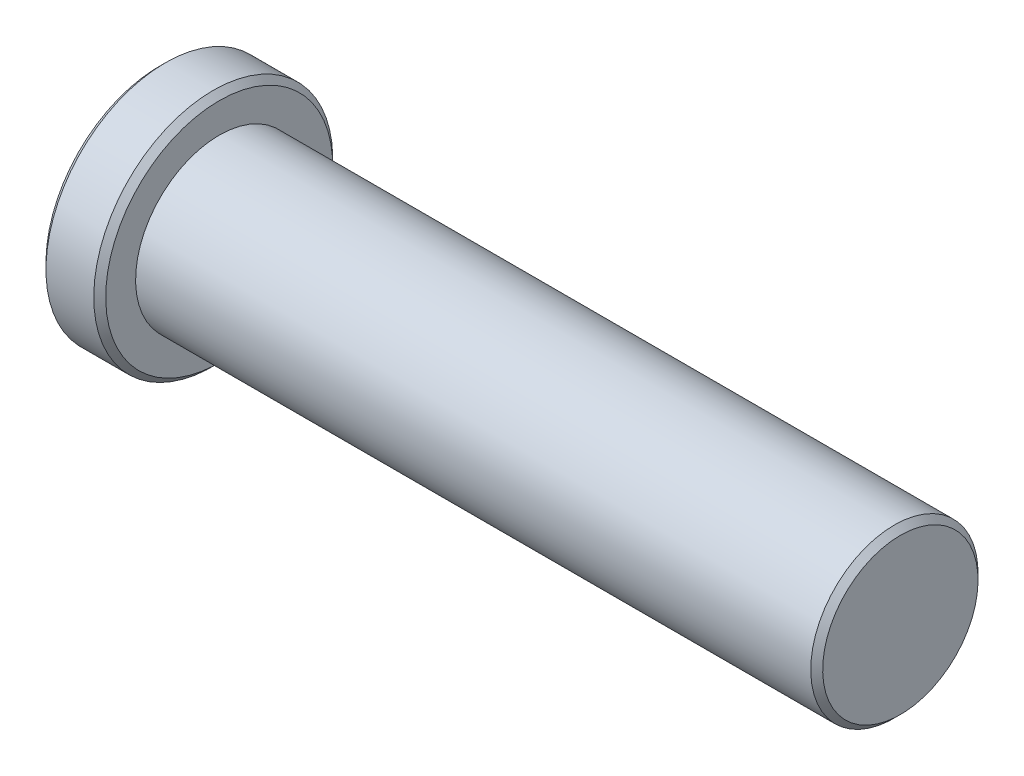
ISO-10303-21;
HEADER;
FILE_DESCRIPTION(('STEP AP214'),'2;1');
FILE_NAME('part.step','',(''),(''),'','','');
FILE_SCHEMA(('AUTOMOTIVE_DESIGN { 1 0 10303 214 1 1 1 1 }'));
ENDSEC;
DATA;
#1=APPLICATION_CONTEXT('core data for automotive mechanical design processes');
#2=APPLICATION_PROTOCOL_DEFINITION('international standard','automotive_design',2000,#1);
#3=PRODUCT_CONTEXT('',#1,'mechanical');
#4=PRODUCT('Part','Part','',(#3));
#5=PRODUCT_RELATED_PRODUCT_CATEGORY('part','',(#4));
#6=PRODUCT_DEFINITION_FORMATION('','',#4);
#7=PRODUCT_DEFINITION_CONTEXT('part definition',#1,'design');
#8=PRODUCT_DEFINITION('design','',#6,#7);
#9=PRODUCT_DEFINITION_SHAPE('','',#8);
#10=(LENGTH_UNIT() NAMED_UNIT(*) SI_UNIT(.MILLI.,.METRE.));
#11=(NAMED_UNIT(*) PLANE_ANGLE_UNIT() SI_UNIT($,.RADIAN.));
#12=(NAMED_UNIT(*) SI_UNIT($,.STERADIAN.) SOLID_ANGLE_UNIT());
#13=UNCERTAINTY_MEASURE_WITH_UNIT(LENGTH_MEASURE(1.E-05),#10,'distance_accuracy_value','');
#14=(GEOMETRIC_REPRESENTATION_CONTEXT(3) GLOBAL_UNCERTAINTY_ASSIGNED_CONTEXT((#13)) GLOBAL_UNIT_ASSIGNED_CONTEXT((#10,
#11,#12)) REPRESENTATION_CONTEXT('',''));
#15=CARTESIAN_POINT('',(0.,0.,0.));
#16=DIRECTION('',(0.,0.,1.));
#17=DIRECTION('',(1.,0.,0.));
#18=AXIS2_PLACEMENT_3D('',#15,#16,#17);
#19=CARTESIAN_POINT('',(0.,0.,0.));
#20=DIRECTION('',(-1.,0.,0.));
#21=DIRECTION('',(0.,-1.,0.));
#22=AXIS2_PLACEMENT_3D('',#19,#20,#21);
#23=PLANE('',#22);
#24=CARTESIAN_POINT('',(0.,0.,0.));
#25=DIRECTION('',(-1.,0.,0.));
#26=DIRECTION('',(0.,-1.,0.));
#27=AXIS2_PLACEMENT_3D('',#24,#25,#26);
#28=CIRCLE('',#27,9.49999999999999);
#29=CARTESIAN_POINT('',(0.,-9.49999999999999,0.));
#30=VERTEX_POINT('',#29);
#31=EDGE_CURVE('E10',#30,#30,#28,.T.);
#32=ORIENTED_EDGE('',*,*,#31,.T.);
#33=EDGE_LOOP('',(#32));
#34=FACE_BOUND('',#33,.T.);
#35=ADVANCED_FACE('F34',(#34),#23,.T.);
#36=CARTESIAN_POINT('',(62.,0.,0.));
#37=DIRECTION('',(1.,0.,0.));
#38=DIRECTION('',(0.,1.,0.));
#39=AXIS2_PLACEMENT_3D('',#36,#37,#38);
#40=CYLINDRICAL_SURFACE('',#39,10.);
#41=CARTESIAN_POINT('',(4.5,0.,0.));
#42=DIRECTION('',(1.,0.,0.));
#43=DIRECTION('',(0.,1.,0.));
#44=AXIS2_PLACEMENT_3D('',#41,#42,#43);
#45=CIRCLE('',#44,10.);
#46=CARTESIAN_POINT('',(4.5,10.,0.));
#47=VERTEX_POINT('',#46);
#48=EDGE_CURVE('E41',#47,#47,#45,.F.);
#49=ORIENTED_EDGE('',*,*,#48,.T.);
#50=EDGE_LOOP('',(#49));
#51=FACE_BOUND('',#50,.T.);
#52=CARTESIAN_POINT('',(0.5,0.,0.));
#53=DIRECTION('',(-1.,0.,0.));
#54=DIRECTION('',(0.,-1.,0.));
#55=AXIS2_PLACEMENT_3D('',#52,#53,#54);
#56=CIRCLE('',#55,10.);
#57=CARTESIAN_POINT('',(0.5,-10.,0.));
#58=VERTEX_POINT('',#57);
#59=EDGE_CURVE('E45',#58,#58,#56,.F.);
#60=ORIENTED_EDGE('',*,*,#59,.T.);
#61=EDGE_LOOP('',(#60));
#62=FACE_BOUND('',#61,.T.);
#63=ADVANCED_FACE('F68',(#51,#62),#40,.T.);
#64=CARTESIAN_POINT('',(5.,10.,0.));
#65=DIRECTION('',(1.,0.,0.));
#66=DIRECTION('',(0.,1.,0.));
#67=AXIS2_PLACEMENT_3D('',#64,#65,#66);
#68=PLANE('',#67);
#69=CARTESIAN_POINT('',(5.,0.,0.));
#70=DIRECTION('',(1.,0.,0.));
#71=DIRECTION('',(0.,1.,0.));
#72=AXIS2_PLACEMENT_3D('',#69,#70,#71);
#73=CIRCLE('',#72,9.49999999999999);
#74=CARTESIAN_POINT('',(5.,9.49999999999999,0.));
#75=VERTEX_POINT('',#74);
#76=EDGE_CURVE('E49',#75,#75,#73,.T.);
#77=ORIENTED_EDGE('',*,*,#76,.T.);
#78=EDGE_LOOP('',(#77));
#79=FACE_BOUND('',#78,.T.);
#80=CARTESIAN_POINT('',(5.,0.,0.));
#81=DIRECTION('',(1.,0.,0.));
#82=DIRECTION('',(0.,1.,0.));
#83=AXIS2_PLACEMENT_3D('',#80,#81,#82);
#84=CIRCLE('',#83,6.99999999999999);
#85=CARTESIAN_POINT('',(5.,6.99999999999999,0.));
#86=VERTEX_POINT('',#85);
#87=EDGE_CURVE('E60',#86,#86,#84,.T.);
#88=ORIENTED_EDGE('',*,*,#87,.F.);
#89=EDGE_LOOP('',(#88));
#90=FACE_BOUND('',#89,.T.);
#91=ADVANCED_FACE('F66',(#79,#90),#68,.T.);
#92=CARTESIAN_POINT('',(62.,0.,0.));
#93=DIRECTION('',(1.,0.,0.));
#94=DIRECTION('',(0.,1.,0.));
#95=AXIS2_PLACEMENT_3D('',#92,#93,#94);
#96=CYLINDRICAL_SURFACE('',#95,6.99999999999999);
#97=CARTESIAN_POINT('',(61.5,0.,0.));
#98=DIRECTION('',(1.,0.,0.));
#99=DIRECTION('',(0.,1.,0.));
#100=AXIS2_PLACEMENT_3D('',#97,#98,#99);
#101=CIRCLE('',#100,6.99999999999999);
#102=CARTESIAN_POINT('',(61.5,6.99999999999999,0.));
#103=VERTEX_POINT('',#102);
#104=EDGE_CURVE('E54',#103,#103,#101,.F.);
#105=ORIENTED_EDGE('',*,*,#104,.T.);
#106=EDGE_LOOP('',(#105));
#107=FACE_BOUND('',#106,.T.);
#108=ORIENTED_EDGE('',*,*,#87,.T.);
#109=EDGE_LOOP('',(#108));
#110=FACE_BOUND('',#109,.T.);
#111=ADVANCED_FACE('F64',(#107,#110),#96,.T.);
#112=CARTESIAN_POINT('',(62.,6.99999999999999,0.));
#113=DIRECTION('',(1.,0.,0.));
#114=DIRECTION('',(0.,1.,0.));
#115=AXIS2_PLACEMENT_3D('',#112,#113,#114);
#116=PLANE('',#115);
#117=CARTESIAN_POINT('',(62.,0.,0.));
#118=DIRECTION('',(1.,0.,0.));
#119=DIRECTION('',(0.,1.,0.));
#120=AXIS2_PLACEMENT_3D('',#117,#118,#119);
#121=CIRCLE('',#120,6.49999999999999);
#122=CARTESIAN_POINT('',(62.,6.49999999999999,0.));
#123=VERTEX_POINT('',#122);
#124=EDGE_CURVE('E57',#123,#123,#121,.T.);
#125=ORIENTED_EDGE('',*,*,#124,.T.);
#126=EDGE_LOOP('',(#125));
#127=FACE_BOUND('',#126,.T.);
#128=ADVANCED_FACE('F75',(#127),#116,.T.);
#129=CARTESIAN_POINT('',(62.,0.,0.));
#130=DIRECTION('',(-1.,0.,0.));
#131=DIRECTION('',(0.,-1.,0.));
#132=AXIS2_PLACEMENT_3D('',#129,#130,#131);
#133=CONICAL_SURFACE('',#132,6.49999999999999,0.785398163397449);
#134=ORIENTED_EDGE('',*,*,#104,.F.);
#135=EDGE_LOOP('',(#134));
#136=FACE_BOUND('',#135,.T.);
#137=ORIENTED_EDGE('',*,*,#124,.F.);
#138=EDGE_LOOP('',(#137));
#139=FACE_BOUND('',#138,.T.);
#140=ADVANCED_FACE('F84',(#136,#139),#133,.T.);
#141=CARTESIAN_POINT('',(5.,0.,0.));
#142=DIRECTION('',(-1.,0.,0.));
#143=DIRECTION('',(0.,-1.,0.));
#144=AXIS2_PLACEMENT_3D('',#141,#142,#143);
#145=CONICAL_SURFACE('',#144,9.49999999999999,0.78539816339745);
#146=ORIENTED_EDGE('',*,*,#48,.F.);
#147=EDGE_LOOP('',(#146));
#148=FACE_BOUND('',#147,.T.);
#149=ORIENTED_EDGE('',*,*,#76,.F.);
#150=EDGE_LOOP('',(#149));
#151=FACE_BOUND('',#150,.T.);
#152=ADVANCED_FACE('F86',(#148,#151),#145,.T.);
#153=CARTESIAN_POINT('',(0.5,0.,0.));
#154=DIRECTION('',(1.,0.,0.));
#155=DIRECTION('',(0.,1.,0.));
#156=AXIS2_PLACEMENT_3D('',#153,#154,#155);
#157=CONICAL_SURFACE('',#156,10.,0.78539816339745);
#158=ORIENTED_EDGE('',*,*,#31,.F.);
#159=EDGE_LOOP('',(#158));
#160=FACE_BOUND('',#159,.T.);
#161=ORIENTED_EDGE('',*,*,#59,.F.);
#162=EDGE_LOOP('',(#161));
#163=FACE_BOUND('',#162,.T.);
#164=ADVANCED_FACE('F36',(#160,#163),#157,.T.);
#165=CLOSED_SHELL('',(#35,#63,#91,#111,#128,#140,#152,#164));
#166=MANIFOLD_SOLID_BREP('B2',#165);
#167=ADVANCED_BREP_SHAPE_REPRESENTATION('',(#18,#166),#14);
#168=SHAPE_DEFINITION_REPRESENTATION(#9,#167);
ENDSEC;
END-ISO-10303-21;
